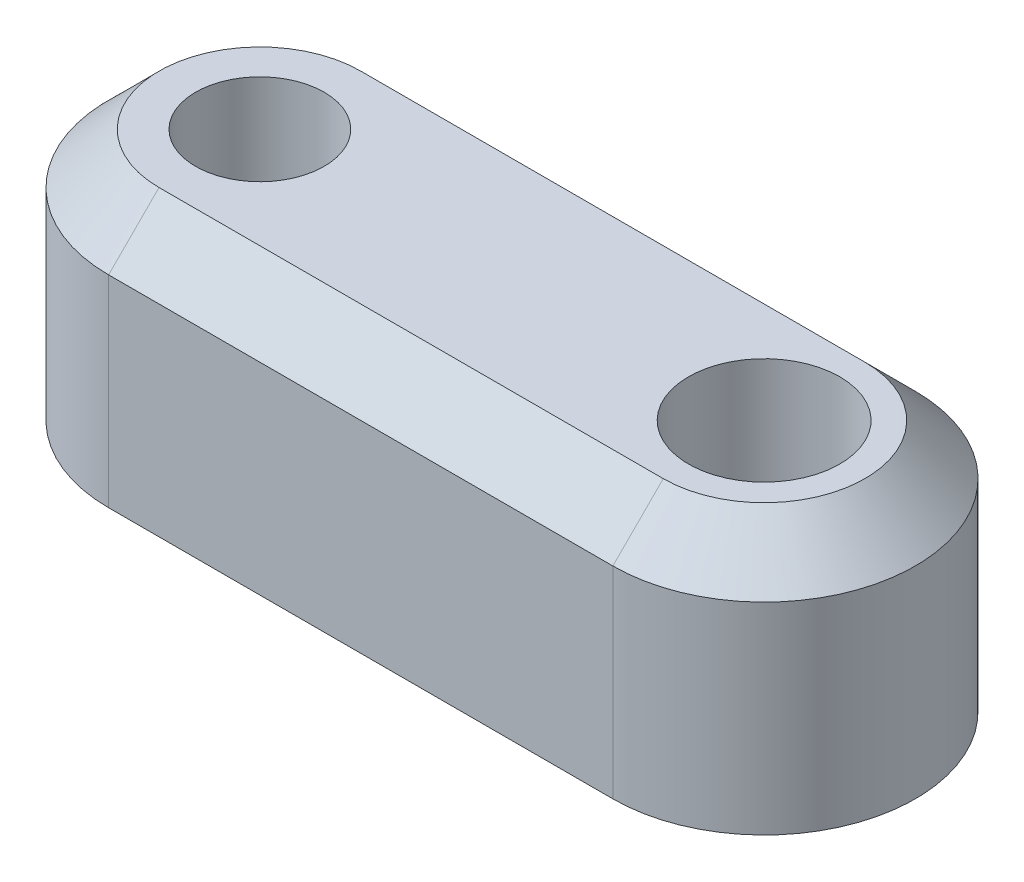
ISO-10303-21;
HEADER;
FILE_DESCRIPTION(('STEP AP214'),'2;1');
FILE_NAME('part.step','',(''),(''),'','','');
FILE_SCHEMA(('AUTOMOTIVE_DESIGN { 1 0 10303 214 1 1 1 1 }'));
ENDSEC;
DATA;
#1=APPLICATION_CONTEXT('core data for automotive mechanical design processes');
#2=APPLICATION_PROTOCOL_DEFINITION('international standard','automotive_design',2000,#1);
#3=PRODUCT_CONTEXT('',#1,'mechanical');
#4=PRODUCT('Part','Part','',(#3));
#5=PRODUCT_RELATED_PRODUCT_CATEGORY('part','',(#4));
#6=PRODUCT_DEFINITION_FORMATION('','',#4);
#7=PRODUCT_DEFINITION_CONTEXT('part definition',#1,'design');
#8=PRODUCT_DEFINITION('design','',#6,#7);
#9=PRODUCT_DEFINITION_SHAPE('','',#8);
#10=(LENGTH_UNIT() NAMED_UNIT(*) SI_UNIT(.MILLI.,.METRE.));
#11=(NAMED_UNIT(*) PLANE_ANGLE_UNIT() SI_UNIT($,.RADIAN.));
#12=(NAMED_UNIT(*) SI_UNIT($,.STERADIAN.) SOLID_ANGLE_UNIT());
#13=UNCERTAINTY_MEASURE_WITH_UNIT(LENGTH_MEASURE(1.E-05),#10,'distance_accuracy_value','');
#14=(GEOMETRIC_REPRESENTATION_CONTEXT(3) GLOBAL_UNCERTAINTY_ASSIGNED_CONTEXT((#13)) GLOBAL_UNIT_ASSIGNED_CONTEXT((#10,
#11,#12)) REPRESENTATION_CONTEXT('',''));
#15=CARTESIAN_POINT('',(0.,0.,0.));
#16=DIRECTION('',(0.,0.,1.));
#17=DIRECTION('',(1.,0.,0.));
#18=AXIS2_PLACEMENT_3D('',#15,#16,#17);
#19=CARTESIAN_POINT('',(0.,10.,0.));
#20=DIRECTION('',(0.,-1.,0.));
#21=DIRECTION('',(0.,0.,-1.));
#22=AXIS2_PLACEMENT_3D('',#19,#20,#21);
#23=CYLINDRICAL_SURFACE('',#22,6.);
#24=DIRECTION('',(0.,-1.,0.));
#25=VECTOR('',#24,1.);
#26=CARTESIAN_POINT('',(0.,10.,6.));
#27=LINE('',#26,#25);
#28=CARTESIAN_POINT('',(0.,7.99999999999999,6.));
#29=VERTEX_POINT('',#28);
#30=CARTESIAN_POINT('',(0.,0.,6.));
#31=VERTEX_POINT('',#30);
#32=EDGE_CURVE('E95',#29,#31,#27,.T.);
#33=ORIENTED_EDGE('',*,*,#32,.F.);
#34=CARTESIAN_POINT('',(0.,7.99999999999999,0.));
#35=DIRECTION('',(0.,1.,0.));
#36=DIRECTION('',(0.,0.,1.));
#37=AXIS2_PLACEMENT_3D('',#34,#35,#36);
#38=CIRCLE('',#37,6.);
#39=CARTESIAN_POINT('',(0.,7.99999999999999,-6.));
#40=VERTEX_POINT('',#39);
#41=EDGE_CURVE('E51',#29,#40,#38,.F.);
#42=ORIENTED_EDGE('',*,*,#41,.T.);
#43=DIRECTION('',(0.,-1.,0.));
#44=VECTOR('',#43,1.);
#45=CARTESIAN_POINT('',(0.,10.,-6.));
#46=LINE('',#45,#44);
#47=CARTESIAN_POINT('',(0.,0.,-6.));
#48=VERTEX_POINT('',#47);
#49=EDGE_CURVE('E117',#40,#48,#46,.T.);
#50=ORIENTED_EDGE('',*,*,#49,.T.);
#51=CARTESIAN_POINT('',(0.,0.,0.));
#52=DIRECTION('',(0.,1.,0.));
#53=DIRECTION('',(0.,0.,1.));
#54=AXIS2_PLACEMENT_3D('',#51,#52,#53);
#55=CIRCLE('',#54,6.);
#56=EDGE_CURVE('E112',#48,#31,#55,.T.);
#57=ORIENTED_EDGE('',*,*,#56,.T.);
#58=EDGE_LOOP('',(#33,#42,#50,#57));
#59=FACE_BOUND('',#58,.T.);
#60=ADVANCED_FACE('F40',(#59),#23,.T.);
#61=CARTESIAN_POINT('',(0.,10.,6.));
#62=DIRECTION('',(0.,0.,-1.));
#63=DIRECTION('',(-1.,0.,0.));
#64=AXIS2_PLACEMENT_3D('',#61,#62,#63);
#65=PLANE('',#64);
#66=DIRECTION('',(0.,-1.,0.));
#67=VECTOR('',#66,1.);
#68=CARTESIAN_POINT('',(20.,10.,6.));
#69=LINE('',#68,#67);
#70=CARTESIAN_POINT('',(20.,7.99999999999999,6.));
#71=VERTEX_POINT('',#70);
#72=CARTESIAN_POINT('',(20.,0.,6.));
#73=VERTEX_POINT('',#72);
#74=EDGE_CURVE('E106',#71,#73,#69,.T.);
#75=ORIENTED_EDGE('',*,*,#74,.F.);
#76=DIRECTION('',(-1.,0.,0.));
#77=VECTOR('',#76,1.);
#78=CARTESIAN_POINT('',(0.,7.99999999999999,6.));
#79=LINE('',#78,#77);
#80=EDGE_CURVE('E102',#71,#29,#79,.T.);
#81=ORIENTED_EDGE('',*,*,#80,.T.);
#82=ORIENTED_EDGE('',*,*,#32,.T.);
#83=DIRECTION('',(1.,0.,0.));
#84=VECTOR('',#83,1.);
#85=CARTESIAN_POINT('',(0.,0.,6.));
#86=LINE('',#85,#84);
#87=EDGE_CURVE('E99',#31,#73,#86,.T.);
#88=ORIENTED_EDGE('',*,*,#87,.T.);
#89=EDGE_LOOP('',(#75,#81,#82,#88));
#90=FACE_BOUND('',#89,.T.);
#91=ADVANCED_FACE('F98',(#90),#65,.F.);
#92=CARTESIAN_POINT('',(20.,10.,0.));
#93=DIRECTION('',(0.,-1.,0.));
#94=DIRECTION('',(0.,0.,-1.));
#95=AXIS2_PLACEMENT_3D('',#92,#93,#94);
#96=CYLINDRICAL_SURFACE('',#95,6.);
#97=DIRECTION('',(0.,-1.,0.));
#98=VECTOR('',#97,1.);
#99=CARTESIAN_POINT('',(20.,10.,-6.));
#100=LINE('',#99,#98);
#101=CARTESIAN_POINT('',(20.,7.99999999999999,-6.));
#102=VERTEX_POINT('',#101);
#103=CARTESIAN_POINT('',(20.,0.,-6.));
#104=VERTEX_POINT('',#103);
#105=EDGE_CURVE('E135',#102,#104,#100,.T.);
#106=ORIENTED_EDGE('',*,*,#105,.F.);
#107=CARTESIAN_POINT('',(20.,7.99999999999999,0.));
#108=DIRECTION('',(0.,1.,0.));
#109=DIRECTION('',(0.,0.,1.));
#110=AXIS2_PLACEMENT_3D('',#107,#108,#109);
#111=CIRCLE('',#110,6.);
#112=EDGE_CURVE('E154',#102,#71,#111,.F.);
#113=ORIENTED_EDGE('',*,*,#112,.T.);
#114=ORIENTED_EDGE('',*,*,#74,.T.);
#115=CARTESIAN_POINT('',(20.,0.,0.));
#116=DIRECTION('',(0.,1.,0.));
#117=DIRECTION('',(0.,0.,1.));
#118=AXIS2_PLACEMENT_3D('',#115,#116,#117);
#119=CIRCLE('',#118,6.);
#120=EDGE_CURVE('E114',#73,#104,#119,.T.);
#121=ORIENTED_EDGE('',*,*,#120,.T.);
#122=EDGE_LOOP('',(#106,#113,#114,#121));
#123=FACE_BOUND('',#122,.T.);
#124=ADVANCED_FACE('F236',(#123),#96,.T.);
#125=CARTESIAN_POINT('',(0.,10.,-6.));
#126=DIRECTION('',(0.,0.,1.));
#127=DIRECTION('',(1.,0.,0.));
#128=AXIS2_PLACEMENT_3D('',#125,#126,#127);
#129=PLANE('',#128);
#130=ORIENTED_EDGE('',*,*,#49,.F.);
#131=DIRECTION('',(1.,0.,0.));
#132=VECTOR('',#131,1.);
#133=CARTESIAN_POINT('',(20.,7.99999999999999,-6.));
#134=LINE('',#133,#132);
#135=EDGE_CURVE('E11',#40,#102,#134,.T.);
#136=ORIENTED_EDGE('',*,*,#135,.T.);
#137=ORIENTED_EDGE('',*,*,#105,.T.);
#138=DIRECTION('',(-1.,0.,0.));
#139=VECTOR('',#138,1.);
#140=CARTESIAN_POINT('',(0.,0.,-6.));
#141=LINE('',#140,#139);
#142=EDGE_CURVE('E130',#104,#48,#141,.T.);
#143=ORIENTED_EDGE('',*,*,#142,.T.);
#144=EDGE_LOOP('',(#130,#136,#137,#143));
#145=FACE_BOUND('',#144,.T.);
#146=ADVANCED_FACE('F276',(#145),#129,.F.);
#147=CARTESIAN_POINT('',(0.,10.,0.));
#148=DIRECTION('',(0.,1.,0.));
#149=DIRECTION('',(0.,0.,1.));
#150=AXIS2_PLACEMENT_3D('',#147,#148,#149);
#151=PLANE('',#150);
#152=CARTESIAN_POINT('',(0.,10.,0.));
#153=DIRECTION('',(0.,1.,0.));
#154=DIRECTION('',(0.,0.,1.));
#155=AXIS2_PLACEMENT_3D('',#152,#153,#154);
#156=CIRCLE('',#155,4.);
#157=CARTESIAN_POINT('',(0.,10.,-4.));
#158=VERTEX_POINT('',#157);
#159=CARTESIAN_POINT('',(0.,10.,4.));
#160=VERTEX_POINT('',#159);
#161=EDGE_CURVE('E142',#158,#160,#156,.T.);
#162=ORIENTED_EDGE('',*,*,#161,.T.);
#163=DIRECTION('',(1.,0.,0.));
#164=VECTOR('',#163,1.);
#165=CARTESIAN_POINT('',(20.,10.,4.));
#166=LINE('',#165,#164);
#167=CARTESIAN_POINT('',(20.,10.,4.));
#168=VERTEX_POINT('',#167);
#169=EDGE_CURVE('E148',#160,#168,#166,.T.);
#170=ORIENTED_EDGE('',*,*,#169,.T.);
#171=CARTESIAN_POINT('',(20.,10.,0.));
#172=DIRECTION('',(0.,1.,0.));
#173=DIRECTION('',(0.,0.,1.));
#174=AXIS2_PLACEMENT_3D('',#171,#172,#173);
#175=CIRCLE('',#174,4.);
#176=CARTESIAN_POINT('',(20.,10.,-4.));
#177=VERTEX_POINT('',#176);
#178=EDGE_CURVE('E145',#168,#177,#175,.T.);
#179=ORIENTED_EDGE('',*,*,#178,.T.);
#180=DIRECTION('',(-1.,0.,0.));
#181=VECTOR('',#180,1.);
#182=CARTESIAN_POINT('',(0.,10.,-4.));
#183=LINE('',#182,#181);
#184=EDGE_CURVE('E105',#177,#158,#183,.T.);
#185=ORIENTED_EDGE('',*,*,#184,.T.);
#186=EDGE_LOOP('',(#162,#170,#179,#185));
#187=FACE_BOUND('',#186,.T.);
#188=CARTESIAN_POINT('',(20.,10.,0.));
#189=DIRECTION('',(0.,-1.,0.));
#190=DIRECTION('',(0.,0.,-1.));
#191=AXIS2_PLACEMENT_3D('',#188,#189,#190);
#192=CIRCLE('',#191,3.);
#193=CARTESIAN_POINT('',(20.,10.,-3.));
#194=VERTEX_POINT('',#193);
#195=EDGE_CURVE('E191',#194,#194,#192,.T.);
#196=ORIENTED_EDGE('',*,*,#195,.T.);
#197=EDGE_LOOP('',(#196));
#198=FACE_BOUND('',#197,.T.);
#199=CARTESIAN_POINT('',(0.,10.,0.));
#200=DIRECTION('',(0.,-1.,0.));
#201=DIRECTION('',(0.,0.,-1.));
#202=AXIS2_PLACEMENT_3D('',#199,#200,#201);
#203=CIRCLE('',#202,2.55);
#204=CARTESIAN_POINT('',(0.,10.,-2.55));
#205=VERTEX_POINT('',#204);
#206=EDGE_CURVE('E120',#205,#205,#203,.T.);
#207=ORIENTED_EDGE('',*,*,#206,.T.);
#208=EDGE_LOOP('',(#207));
#209=FACE_BOUND('',#208,.T.);
#210=ADVANCED_FACE('F273',(#187,#198,#209),#151,.T.);
#211=CARTESIAN_POINT('',(0.,0.,0.));
#212=DIRECTION('',(0.,1.,0.));
#213=DIRECTION('',(0.,0.,1.));
#214=AXIS2_PLACEMENT_3D('',#211,#212,#213);
#215=PLANE('',#214);
#216=CARTESIAN_POINT('',(20.,0.,0.));
#217=DIRECTION('',(0.,-1.,0.));
#218=DIRECTION('',(0.,0.,-1.));
#219=AXIS2_PLACEMENT_3D('',#216,#217,#218);
#220=CIRCLE('',#219,2.575);
#221=CARTESIAN_POINT('',(20.,0.,-2.575));
#222=VERTEX_POINT('',#221);
#223=EDGE_CURVE('E173',#222,#222,#220,.T.);
#224=ORIENTED_EDGE('',*,*,#223,.F.);
#225=EDGE_LOOP('',(#224));
#226=FACE_BOUND('',#225,.T.);
#227=CARTESIAN_POINT('',(0.,0.,0.));
#228=DIRECTION('',(0.,-1.,0.));
#229=DIRECTION('',(0.,0.,-1.));
#230=AXIS2_PLACEMENT_3D('',#227,#228,#229);
#231=CIRCLE('',#230,2.55);
#232=CARTESIAN_POINT('',(0.,0.,-2.55));
#233=VERTEX_POINT('',#232);
#234=EDGE_CURVE('E195',#233,#233,#231,.T.);
#235=ORIENTED_EDGE('',*,*,#234,.F.);
#236=EDGE_LOOP('',(#235));
#237=FACE_BOUND('',#236,.T.);
#238=ORIENTED_EDGE('',*,*,#56,.F.);
#239=ORIENTED_EDGE('',*,*,#142,.F.);
#240=ORIENTED_EDGE('',*,*,#120,.F.);
#241=ORIENTED_EDGE('',*,*,#87,.F.);
#242=EDGE_LOOP('',(#238,#239,#240,#241));
#243=FACE_BOUND('',#242,.T.);
#244=ADVANCED_FACE('F110',(#226,#237,#243),#215,.F.);
#245=CARTESIAN_POINT('',(0.,0.,0.));
#246=DIRECTION('',(0.,-1.,0.));
#247=DIRECTION('',(0.,0.,-1.));
#248=AXIS2_PLACEMENT_3D('',#245,#246,#247);
#249=CYLINDRICAL_SURFACE('',#248,2.55);
#250=CARTESIAN_POINT('',(0.,5.,0.));
#251=DIRECTION('',(0.,-1.,0.));
#252=DIRECTION('',(0.,0.,-1.));
#253=AXIS2_PLACEMENT_3D('',#250,#251,#252);
#254=CIRCLE('',#253,2.55);
#255=CARTESIAN_POINT('',(0.,5.,-2.55));
#256=VERTEX_POINT('',#255);
#257=EDGE_CURVE('E124',#256,#256,#254,.T.);
#258=ORIENTED_EDGE('',*,*,#257,.T.);
#259=EDGE_LOOP('',(#258));
#260=FACE_BOUND('',#259,.T.);
#261=ORIENTED_EDGE('',*,*,#206,.F.);
#262=EDGE_LOOP('',(#261));
#263=FACE_BOUND('',#262,.T.);
#264=ADVANCED_FACE('F214',(#260,#263),#249,.F.);
#265=CARTESIAN_POINT('',(-2.55,5.,0.));
#266=DIRECTION('',(0.,1.,0.));
#267=DIRECTION('',(0.,0.,1.));
#268=AXIS2_PLACEMENT_3D('',#265,#266,#267);
#269=PLANE('',#268);
#270=CARTESIAN_POINT('',(0.,5.,0.));
#271=DIRECTION('',(0.,-1.,0.));
#272=DIRECTION('',(0.,0.,-1.));
#273=AXIS2_PLACEMENT_3D('',#270,#271,#272);
#274=CIRCLE('',#273,1.6);
#275=CARTESIAN_POINT('',(0.,5.,-1.6));
#276=VERTEX_POINT('',#275);
#277=EDGE_CURVE('E207',#276,#276,#274,.T.);
#278=ORIENTED_EDGE('',*,*,#277,.T.);
#279=EDGE_LOOP('',(#278));
#280=FACE_BOUND('',#279,.T.);
#281=ORIENTED_EDGE('',*,*,#257,.F.);
#282=EDGE_LOOP('',(#281));
#283=FACE_BOUND('',#282,.T.);
#284=ADVANCED_FACE('F217',(#280,#283),#269,.T.);
#285=CARTESIAN_POINT('',(0.,0.,0.));
#286=DIRECTION('',(0.,-1.,0.));
#287=DIRECTION('',(0.,0.,-1.));
#288=AXIS2_PLACEMENT_3D('',#285,#286,#287);
#289=CYLINDRICAL_SURFACE('',#288,1.6);
#290=CARTESIAN_POINT('',(0.,2.,0.));
#291=DIRECTION('',(0.,-1.,0.));
#292=DIRECTION('',(0.,0.,-1.));
#293=AXIS2_PLACEMENT_3D('',#290,#291,#292);
#294=CIRCLE('',#293,1.6);
#295=CARTESIAN_POINT('',(0.,2.,-1.6));
#296=VERTEX_POINT('',#295);
#297=EDGE_CURVE('E203',#296,#296,#294,.T.);
#298=ORIENTED_EDGE('',*,*,#297,.T.);
#299=EDGE_LOOP('',(#298));
#300=FACE_BOUND('',#299,.T.);
#301=ORIENTED_EDGE('',*,*,#277,.F.);
#302=EDGE_LOOP('',(#301));
#303=FACE_BOUND('',#302,.T.);
#304=ADVANCED_FACE('F219',(#300,#303),#289,.F.);
#305=CARTESIAN_POINT('',(-1.6,2.,0.));
#306=DIRECTION('',(0.,-1.,0.));
#307=DIRECTION('',(0.,0.,-1.));
#308=AXIS2_PLACEMENT_3D('',#305,#306,#307);
#309=PLANE('',#308);
#310=CARTESIAN_POINT('',(0.,2.,0.));
#311=DIRECTION('',(0.,-1.,0.));
#312=DIRECTION('',(0.,0.,-1.));
#313=AXIS2_PLACEMENT_3D('',#310,#311,#312);
#314=CIRCLE('',#313,2.55);
#315=CARTESIAN_POINT('',(0.,2.,-2.55));
#316=VERTEX_POINT('',#315);
#317=EDGE_CURVE('E199',#316,#316,#314,.T.);
#318=ORIENTED_EDGE('',*,*,#317,.T.);
#319=EDGE_LOOP('',(#318));
#320=FACE_BOUND('',#319,.T.);
#321=ORIENTED_EDGE('',*,*,#297,.F.);
#322=EDGE_LOOP('',(#321));
#323=FACE_BOUND('',#322,.T.);
#324=ADVANCED_FACE('F226',(#320,#323),#309,.T.);
#325=CARTESIAN_POINT('',(0.,0.,0.));
#326=DIRECTION('',(0.,-1.,0.));
#327=DIRECTION('',(0.,0.,-1.));
#328=AXIS2_PLACEMENT_3D('',#325,#326,#327);
#329=CYLINDRICAL_SURFACE('',#328,2.55);
#330=ORIENTED_EDGE('',*,*,#234,.T.);
#331=EDGE_LOOP('',(#330));
#332=FACE_BOUND('',#331,.T.);
#333=ORIENTED_EDGE('',*,*,#317,.F.);
#334=EDGE_LOOP('',(#333));
#335=FACE_BOUND('',#334,.T.);
#336=ADVANCED_FACE('F284',(#332,#335),#329,.F.);
#337=CARTESIAN_POINT('',(20.,0.,0.));
#338=DIRECTION('',(0.,-1.,0.));
#339=DIRECTION('',(0.,0.,-1.));
#340=AXIS2_PLACEMENT_3D('',#337,#338,#339);
#341=CYLINDRICAL_SURFACE('',#340,3.);
#342=CARTESIAN_POINT('',(20.,5.,0.));
#343=DIRECTION('',(0.,-1.,0.));
#344=DIRECTION('',(0.,0.,-1.));
#345=AXIS2_PLACEMENT_3D('',#342,#343,#344);
#346=CIRCLE('',#345,3.);
#347=CARTESIAN_POINT('',(20.,5.,-3.));
#348=VERTEX_POINT('',#347);
#349=EDGE_CURVE('E185',#348,#348,#346,.T.);
#350=ORIENTED_EDGE('',*,*,#349,.T.);
#351=EDGE_LOOP('',(#350));
#352=FACE_BOUND('',#351,.T.);
#353=ORIENTED_EDGE('',*,*,#195,.F.);
#354=EDGE_LOOP('',(#353));
#355=FACE_BOUND('',#354,.T.);
#356=ADVANCED_FACE('F282',(#352,#355),#341,.F.);
#357=CARTESIAN_POINT('',(17.,5.,0.));
#358=DIRECTION('',(0.,1.,0.));
#359=DIRECTION('',(0.,0.,1.));
#360=AXIS2_PLACEMENT_3D('',#357,#358,#359);
#361=PLANE('',#360);
#362=CARTESIAN_POINT('',(20.,5.,0.));
#363=DIRECTION('',(0.,-1.,0.));
#364=DIRECTION('',(0.,0.,-1.));
#365=AXIS2_PLACEMENT_3D('',#362,#363,#364);
#366=CIRCLE('',#365,2.575);
#367=CARTESIAN_POINT('',(20.,5.,-2.575));
#368=VERTEX_POINT('',#367);
#369=EDGE_CURVE('E179',#368,#368,#366,.T.);
#370=ORIENTED_EDGE('',*,*,#369,.T.);
#371=EDGE_LOOP('',(#370));
#372=FACE_BOUND('',#371,.T.);
#373=ORIENTED_EDGE('',*,*,#349,.F.);
#374=EDGE_LOOP('',(#373));
#375=FACE_BOUND('',#374,.T.);
#376=ADVANCED_FACE('F265',(#372,#375),#361,.T.);
#377=CARTESIAN_POINT('',(20.,0.,0.));
#378=DIRECTION('',(0.,-1.,0.));
#379=DIRECTION('',(0.,0.,-1.));
#380=AXIS2_PLACEMENT_3D('',#377,#378,#379);
#381=CYLINDRICAL_SURFACE('',#380,2.575);
#382=ORIENTED_EDGE('',*,*,#223,.T.);
#383=EDGE_LOOP('',(#382));
#384=FACE_BOUND('',#383,.T.);
#385=ORIENTED_EDGE('',*,*,#369,.F.);
#386=EDGE_LOOP('',(#385));
#387=FACE_BOUND('',#386,.T.);
#388=ADVANCED_FACE('F260',(#384,#387),#381,.F.);
#389=CARTESIAN_POINT('',(0.,10.,-4.));
#390=DIRECTION('',(0.,0.707106781186546,-0.707106781186549));
#391=DIRECTION('',(1.,0.,0.));
#392=AXIS2_PLACEMENT_3D('',#389,#390,#391);
#393=PLANE('',#392);
#394=DIRECTION('',(0.,0.707106781186549,0.707106781186546));
#395=VECTOR('',#394,1.);
#396=CARTESIAN_POINT('',(20.,7.99999999999999,-6.));
#397=LINE('',#396,#395);
#398=EDGE_CURVE('E164',#102,#177,#397,.T.);
#399=ORIENTED_EDGE('',*,*,#398,.F.);
#400=ORIENTED_EDGE('',*,*,#135,.F.);
#401=DIRECTION('',(0.,-0.707106781186549,-0.707106781186546));
#402=VECTOR('',#401,1.);
#403=CARTESIAN_POINT('',(0.,10.,-4.));
#404=LINE('',#403,#402);
#405=EDGE_CURVE('E45',#158,#40,#404,.T.);
#406=ORIENTED_EDGE('',*,*,#405,.F.);
#407=ORIENTED_EDGE('',*,*,#184,.F.);
#408=EDGE_LOOP('',(#399,#400,#406,#407));
#409=FACE_BOUND('',#408,.T.);
#410=ADVANCED_FACE('F43',(#409),#393,.T.);
#411=CARTESIAN_POINT('',(0.,10.,0.));
#412=DIRECTION('',(0.,-1.,0.));
#413=DIRECTION('',(0.,0.,-1.));
#414=AXIS2_PLACEMENT_3D('',#411,#412,#413);
#415=CONICAL_SURFACE('',#414,4.,0.785398163397447);
#416=ORIENTED_EDGE('',*,*,#405,.T.);
#417=ORIENTED_EDGE('',*,*,#41,.F.);
#418=DIRECTION('',(0.,-0.707106781186549,0.707106781186546));
#419=VECTOR('',#418,1.);
#420=CARTESIAN_POINT('',(0.,10.,4.));
#421=LINE('',#420,#419);
#422=EDGE_CURVE('E162',#160,#29,#421,.T.);
#423=ORIENTED_EDGE('',*,*,#422,.F.);
#424=ORIENTED_EDGE('',*,*,#161,.F.);
#425=EDGE_LOOP('',(#416,#417,#423,#424));
#426=FACE_BOUND('',#425,.T.);
#427=ADVANCED_FACE('F253',(#426),#415,.T.);
#428=CARTESIAN_POINT('',(20.,10.,0.));
#429=DIRECTION('',(0.,-1.,0.));
#430=DIRECTION('',(0.,0.,-1.));
#431=AXIS2_PLACEMENT_3D('',#428,#429,#430);
#432=CONICAL_SURFACE('',#431,4.,0.785398163397447);
#433=ORIENTED_EDGE('',*,*,#398,.T.);
#434=ORIENTED_EDGE('',*,*,#178,.F.);
#435=DIRECTION('',(0.,0.707106781186549,-0.707106781186546));
#436=VECTOR('',#435,1.);
#437=CARTESIAN_POINT('',(20.,7.99999999999999,6.));
#438=LINE('',#437,#436);
#439=EDGE_CURVE('E159',#71,#168,#438,.T.);
#440=ORIENTED_EDGE('',*,*,#439,.F.);
#441=ORIENTED_EDGE('',*,*,#112,.F.);
#442=EDGE_LOOP('',(#433,#434,#440,#441));
#443=FACE_BOUND('',#442,.T.);
#444=ADVANCED_FACE('F247',(#443),#432,.T.);
#445=CARTESIAN_POINT('',(0.,10.,4.));
#446=DIRECTION('',(0.,0.707106781186546,0.707106781186549));
#447=DIRECTION('',(-1.,0.,0.));
#448=AXIS2_PLACEMENT_3D('',#445,#446,#447);
#449=PLANE('',#448);
#450=ORIENTED_EDGE('',*,*,#422,.T.);
#451=ORIENTED_EDGE('',*,*,#80,.F.);
#452=ORIENTED_EDGE('',*,*,#439,.T.);
#453=ORIENTED_EDGE('',*,*,#169,.F.);
#454=EDGE_LOOP('',(#450,#451,#452,#453));
#455=FACE_BOUND('',#454,.T.);
#456=ADVANCED_FACE('F241',(#455),#449,.T.);
#457=CLOSED_SHELL('',(#60,#91,#124,#146,#210,#244,#264,#284,#304,#324,#336,#356,#376,#388,#410,
#427,#444,#456));
#458=MANIFOLD_SOLID_BREP('B2',#457);
#459=ADVANCED_BREP_SHAPE_REPRESENTATION('',(#18,#458),#14);
#460=SHAPE_DEFINITION_REPRESENTATION(#9,#459);
ENDSEC;
END-ISO-10303-21;
